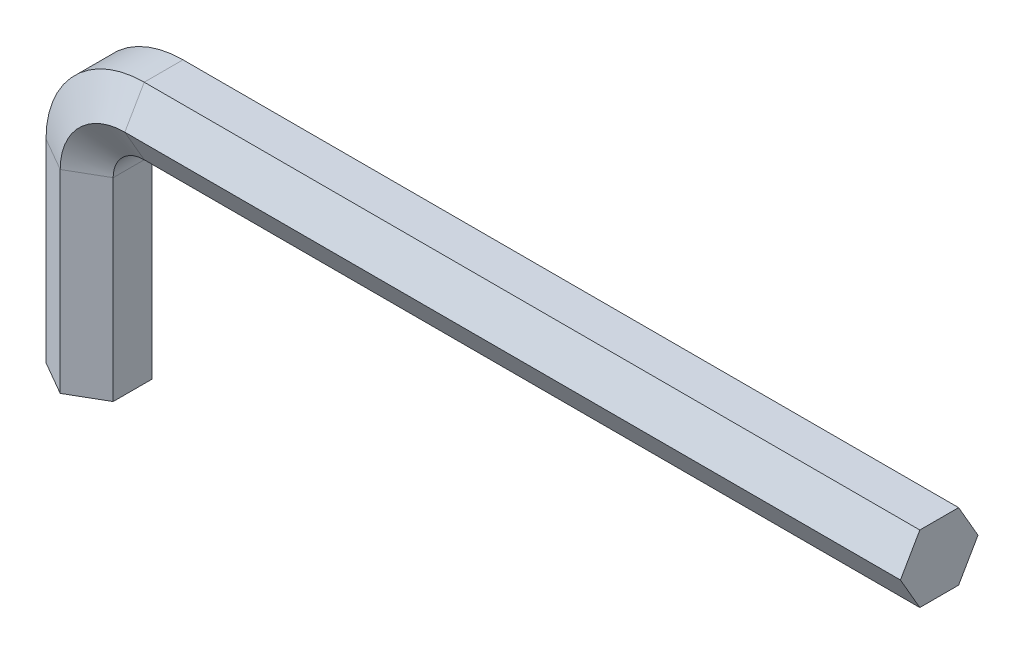
ISO-10303-21;
HEADER;
FILE_DESCRIPTION(('STEP AP214'),'2;1');
FILE_NAME('part.step','',(''),(''),'','','');
FILE_SCHEMA(('AUTOMOTIVE_DESIGN { 1 0 10303 214 1 1 1 1 }'));
ENDSEC;
DATA;
#1=APPLICATION_CONTEXT('core data for automotive mechanical design processes');
#2=APPLICATION_PROTOCOL_DEFINITION('international standard','automotive_design',2000,#1);
#3=PRODUCT_CONTEXT('',#1,'mechanical');
#4=PRODUCT('Part','Part','',(#3));
#5=PRODUCT_RELATED_PRODUCT_CATEGORY('part','',(#4));
#6=PRODUCT_DEFINITION_FORMATION('','',#4);
#7=PRODUCT_DEFINITION_CONTEXT('part definition',#1,'design');
#8=PRODUCT_DEFINITION('design','',#6,#7);
#9=PRODUCT_DEFINITION_SHAPE('','',#8);
#10=(LENGTH_UNIT() NAMED_UNIT(*) SI_UNIT(.MILLI.,.METRE.));
#11=(NAMED_UNIT(*) PLANE_ANGLE_UNIT() SI_UNIT($,.RADIAN.));
#12=(NAMED_UNIT(*) SI_UNIT($,.STERADIAN.) SOLID_ANGLE_UNIT());
#13=UNCERTAINTY_MEASURE_WITH_UNIT(LENGTH_MEASURE(1.E-05),#10,'distance_accuracy_value','');
#14=(GEOMETRIC_REPRESENTATION_CONTEXT(3) GLOBAL_UNCERTAINTY_ASSIGNED_CONTEXT((#13)) GLOBAL_UNIT_ASSIGNED_CONTEXT((#10,
#11,#12)) REPRESENTATION_CONTEXT('',''));
#15=CARTESIAN_POINT('',(0.,0.,0.));
#16=DIRECTION('',(0.,0.,1.));
#17=DIRECTION('',(1.,0.,0.));
#18=AXIS2_PLACEMENT_3D('',#15,#16,#17);
#19=CARTESIAN_POINT('',(20.,0.,0.));
#20=DIRECTION('',(0.,1.,0.));
#21=DIRECTION('',(0.,0.,-1.));
#22=AXIS2_PLACEMENT_3D('',#19,#20,#21);
#23=PLANE('',#22);
#24=DIRECTION('',(-0.866025403784439,0.,-0.5));
#25=VECTOR('',#24,1.);
#26=CARTESIAN_POINT('',(2.59807621135332,0.,-1.5));
#27=LINE('',#26,#25);
#28=CARTESIAN_POINT('',(2.59807621135332,0.,-1.5));
#29=VERTEX_POINT('',#28);
#30=CARTESIAN_POINT('',(0.,0.,-3.));
#31=VERTEX_POINT('',#30);
#32=EDGE_CURVE('E194',#29,#31,#27,.T.);
#33=ORIENTED_EDGE('',*,*,#32,.F.);
#34=DIRECTION('',(0.,0.,-1.));
#35=VECTOR('',#34,1.);
#36=CARTESIAN_POINT('',(2.59807621135332,0.,1.5));
#37=LINE('',#36,#35);
#38=CARTESIAN_POINT('',(2.59807621135332,0.,1.5));
#39=VERTEX_POINT('',#38);
#40=EDGE_CURVE('E256',#39,#29,#37,.T.);
#41=ORIENTED_EDGE('',*,*,#40,.F.);
#42=DIRECTION('',(0.866025403784439,0.,-0.5));
#43=VECTOR('',#42,1.);
#44=CARTESIAN_POINT('',(0.,0.,3.));
#45=LINE('',#44,#43);
#46=CARTESIAN_POINT('',(0.,0.,3.));
#47=VERTEX_POINT('',#46);
#48=EDGE_CURVE('E236',#47,#39,#45,.T.);
#49=ORIENTED_EDGE('',*,*,#48,.F.);
#50=DIRECTION('',(0.866025403784439,0.,0.5));
#51=VECTOR('',#50,1.);
#52=CARTESIAN_POINT('',(-2.59807621135332,0.,1.5));
#53=LINE('',#52,#51);
#54=CARTESIAN_POINT('',(-2.59807621135332,0.,1.5));
#55=VERTEX_POINT('',#54);
#56=EDGE_CURVE('E141',#55,#47,#53,.T.);
#57=ORIENTED_EDGE('',*,*,#56,.F.);
#58=DIRECTION('',(0.,0.,1.));
#59=VECTOR('',#58,1.);
#60=CARTESIAN_POINT('',(-2.59807621135332,0.,-1.5));
#61=LINE('',#60,#59);
#62=CARTESIAN_POINT('',(-2.59807621135332,0.,-1.5));
#63=VERTEX_POINT('',#62);
#64=EDGE_CURVE('E145',#63,#55,#61,.T.);
#65=ORIENTED_EDGE('',*,*,#64,.F.);
#66=DIRECTION('',(-0.866025403784439,0.,0.5));
#67=VECTOR('',#66,1.);
#68=CARTESIAN_POINT('',(0.,0.,-3.));
#69=LINE('',#68,#67);
#70=EDGE_CURVE('E150',#31,#63,#69,.T.);
#71=ORIENTED_EDGE('',*,*,#70,.F.);
#72=EDGE_LOOP('',(#33,#41,#49,#57,#65,#71));
#73=FACE_BOUND('',#72,.T.);
#74=ADVANCED_FACE('F39',(#73),#23,.F.);
#75=CARTESIAN_POINT('',(65.,0.,0.));
#76=DIRECTION('',(1.,0.,0.));
#77=DIRECTION('',(0.,0.,-1.));
#78=AXIS2_PLACEMENT_3D('',#75,#76,#77);
#79=PLANE('',#78);
#80=DIRECTION('',(0.,0.866025403784439,-0.5));
#81=VECTOR('',#80,1.);
#82=CARTESIAN_POINT('',(65.,17.4019237886467,-1.5));
#83=LINE('',#82,#81);
#84=CARTESIAN_POINT('',(65.,17.4019237886467,-1.5));
#85=VERTEX_POINT('',#84);
#86=CARTESIAN_POINT('',(65.,20.,-3.));
#87=VERTEX_POINT('',#86);
#88=EDGE_CURVE('E161',#85,#87,#83,.T.);
#89=ORIENTED_EDGE('',*,*,#88,.T.);
#90=DIRECTION('',(0.,0.866025403784439,0.5));
#91=VECTOR('',#90,1.);
#92=CARTESIAN_POINT('',(65.,20.,-3.));
#93=LINE('',#92,#91);
#94=CARTESIAN_POINT('',(65.,22.5980762113533,-1.5));
#95=VERTEX_POINT('',#94);
#96=EDGE_CURVE('E164',#87,#95,#93,.T.);
#97=ORIENTED_EDGE('',*,*,#96,.T.);
#98=DIRECTION('',(0.,0.,1.));
#99=VECTOR('',#98,1.);
#100=CARTESIAN_POINT('',(65.,22.5980762113533,-1.5));
#101=LINE('',#100,#99);
#102=CARTESIAN_POINT('',(65.,22.5980762113533,1.5));
#103=VERTEX_POINT('',#102);
#104=EDGE_CURVE('E214',#95,#103,#101,.T.);
#105=ORIENTED_EDGE('',*,*,#104,.T.);
#106=DIRECTION('',(0.,-0.866025403784439,0.5));
#107=VECTOR('',#106,1.);
#108=CARTESIAN_POINT('',(65.,22.5980762113533,1.5));
#109=LINE('',#108,#107);
#110=CARTESIAN_POINT('',(65.,20.,3.));
#111=VERTEX_POINT('',#110);
#112=EDGE_CURVE('E59',#103,#111,#109,.T.);
#113=ORIENTED_EDGE('',*,*,#112,.T.);
#114=DIRECTION('',(0.,-0.866025403784439,-0.5));
#115=VECTOR('',#114,1.);
#116=CARTESIAN_POINT('',(65.,20.,3.));
#117=LINE('',#116,#115);
#118=CARTESIAN_POINT('',(65.,17.4019237886467,1.5));
#119=VERTEX_POINT('',#118);
#120=EDGE_CURVE('E53',#111,#119,#117,.T.);
#121=ORIENTED_EDGE('',*,*,#120,.T.);
#122=DIRECTION('',(0.,0.,-1.));
#123=VECTOR('',#122,1.);
#124=CARTESIAN_POINT('',(65.,17.4019237886467,1.5));
#125=LINE('',#124,#123);
#126=EDGE_CURVE('E11',#119,#85,#125,.T.);
#127=ORIENTED_EDGE('',*,*,#126,.T.);
#128=EDGE_LOOP('',(#89,#97,#105,#113,#121,#127));
#129=FACE_BOUND('',#128,.T.);
#130=ADVANCED_FACE('F163',(#129),#79,.T.);
#131=CARTESIAN_POINT('',(2.59807621135332,0.,-1.5));
#132=DIRECTION('',(0.5,0.,-0.866025403784439));
#133=DIRECTION('',(-0.866025403784439,0.,-0.5));
#134=AXIS2_PLACEMENT_3D('',#131,#132,#133);
#135=PLANE('',#134);
#136=DIRECTION('',(0.,1.,0.));
#137=VECTOR('',#136,1.);
#138=CARTESIAN_POINT('',(0.,0.,-3.));
#139=LINE('',#138,#137);
#140=CARTESIAN_POINT('',(0.,15.,-3.));
#141=VERTEX_POINT('',#140);
#142=EDGE_CURVE('E200',#31,#141,#139,.T.);
#143=ORIENTED_EDGE('',*,*,#142,.T.);
#144=DIRECTION('',(-0.866025403784439,0.,-0.5));
#145=VECTOR('',#144,1.);
#146=CARTESIAN_POINT('',(2.59807621135332,15.,-1.5));
#147=LINE('',#146,#145);
#148=CARTESIAN_POINT('',(2.59807621135332,15.,-1.5));
#149=VERTEX_POINT('',#148);
#150=EDGE_CURVE('E301',#149,#141,#147,.T.);
#151=ORIENTED_EDGE('',*,*,#150,.F.);
#152=DIRECTION('',(0.,1.,0.));
#153=VECTOR('',#152,1.);
#154=CARTESIAN_POINT('',(2.59807621135332,0.,-1.5));
#155=LINE('',#154,#153);
#156=EDGE_CURVE('E277',#29,#149,#155,.T.);
#157=ORIENTED_EDGE('',*,*,#156,.F.);
#158=ORIENTED_EDGE('',*,*,#32,.T.);
#159=EDGE_LOOP('',(#143,#151,#157,#158));
#160=FACE_BOUND('',#159,.T.);
#161=ADVANCED_FACE('F311',(#160),#135,.T.);
#162=CARTESIAN_POINT('',(0.,0.,-3.));
#163=DIRECTION('',(-0.5,0.,-0.866025403784439));
#164=DIRECTION('',(-0.866025403784439,0.,0.5));
#165=AXIS2_PLACEMENT_3D('',#162,#163,#164);
#166=PLANE('',#165);
#167=DIRECTION('',(0.,1.,0.));
#168=VECTOR('',#167,1.);
#169=CARTESIAN_POINT('',(-2.59807621135332,0.,-1.5));
#170=LINE('',#169,#168);
#171=CARTESIAN_POINT('',(-2.59807621135332,15.,-1.5));
#172=VERTEX_POINT('',#171);
#173=EDGE_CURVE('E199',#63,#172,#170,.T.);
#174=ORIENTED_EDGE('',*,*,#173,.T.);
#175=DIRECTION('',(-0.866025403784439,0.,0.5));
#176=VECTOR('',#175,1.);
#177=CARTESIAN_POINT('',(0.,15.,-3.));
#178=LINE('',#177,#176);
#179=EDGE_CURVE('E195',#141,#172,#178,.T.);
#180=ORIENTED_EDGE('',*,*,#179,.F.);
#181=ORIENTED_EDGE('',*,*,#142,.F.);
#182=ORIENTED_EDGE('',*,*,#70,.T.);
#183=EDGE_LOOP('',(#174,#180,#181,#182));
#184=FACE_BOUND('',#183,.T.);
#185=ADVANCED_FACE('F314',(#184),#166,.T.);
#186=CARTESIAN_POINT('',(-2.59807621135332,0.,-1.5));
#187=DIRECTION('',(-1.,0.,0.));
#188=DIRECTION('',(0.,0.,1.));
#189=AXIS2_PLACEMENT_3D('',#186,#187,#188);
#190=PLANE('',#189);
#191=DIRECTION('',(0.,1.,0.));
#192=VECTOR('',#191,1.);
#193=CARTESIAN_POINT('',(-2.59807621135332,0.,1.5));
#194=LINE('',#193,#192);
#195=CARTESIAN_POINT('',(-2.59807621135332,15.,1.5));
#196=VERTEX_POINT('',#195);
#197=EDGE_CURVE('E219',#55,#196,#194,.T.);
#198=ORIENTED_EDGE('',*,*,#197,.T.);
#199=DIRECTION('',(0.,0.,1.));
#200=VECTOR('',#199,1.);
#201=CARTESIAN_POINT('',(-2.59807621135332,15.,-1.5));
#202=LINE('',#201,#200);
#203=EDGE_CURVE('E204',#172,#196,#202,.T.);
#204=ORIENTED_EDGE('',*,*,#203,.F.);
#205=ORIENTED_EDGE('',*,*,#173,.F.);
#206=ORIENTED_EDGE('',*,*,#64,.T.);
#207=EDGE_LOOP('',(#198,#204,#205,#206));
#208=FACE_BOUND('',#207,.T.);
#209=ADVANCED_FACE('F368',(#208),#190,.T.);
#210=CARTESIAN_POINT('',(-2.59807621135332,0.,1.5));
#211=DIRECTION('',(-0.5,0.,0.866025403784439));
#212=DIRECTION('',(0.866025403784439,0.,0.5));
#213=AXIS2_PLACEMENT_3D('',#210,#211,#212);
#214=PLANE('',#213);
#215=DIRECTION('',(0.,1.,0.));
#216=VECTOR('',#215,1.);
#217=CARTESIAN_POINT('',(0.,0.,3.));
#218=LINE('',#217,#216);
#219=CARTESIAN_POINT('',(0.,15.,3.));
#220=VERTEX_POINT('',#219);
#221=EDGE_CURVE('E239',#47,#220,#218,.T.);
#222=ORIENTED_EDGE('',*,*,#221,.T.);
#223=DIRECTION('',(0.866025403784439,0.,0.5));
#224=VECTOR('',#223,1.);
#225=CARTESIAN_POINT('',(-2.59807621135332,15.,1.5));
#226=LINE('',#225,#224);
#227=EDGE_CURVE('E223',#196,#220,#226,.T.);
#228=ORIENTED_EDGE('',*,*,#227,.F.);
#229=ORIENTED_EDGE('',*,*,#197,.F.);
#230=ORIENTED_EDGE('',*,*,#56,.T.);
#231=EDGE_LOOP('',(#222,#228,#229,#230));
#232=FACE_BOUND('',#231,.T.);
#233=ADVANCED_FACE('F376',(#232),#214,.T.);
#234=CARTESIAN_POINT('',(0.,0.,3.));
#235=DIRECTION('',(0.5,0.,0.866025403784439));
#236=DIRECTION('',(0.866025403784439,0.,-0.5));
#237=AXIS2_PLACEMENT_3D('',#234,#235,#236);
#238=PLANE('',#237);
#239=DIRECTION('',(0.,1.,0.));
#240=VECTOR('',#239,1.);
#241=CARTESIAN_POINT('',(2.59807621135332,0.,1.5));
#242=LINE('',#241,#240);
#243=CARTESIAN_POINT('',(2.59807621135332,15.,1.5));
#244=VERTEX_POINT('',#243);
#245=EDGE_CURVE('E259',#39,#244,#242,.T.);
#246=ORIENTED_EDGE('',*,*,#245,.T.);
#247=DIRECTION('',(0.866025403784439,0.,-0.5));
#248=VECTOR('',#247,1.);
#249=CARTESIAN_POINT('',(0.,15.,3.));
#250=LINE('',#249,#248);
#251=EDGE_CURVE('E243',#220,#244,#250,.T.);
#252=ORIENTED_EDGE('',*,*,#251,.F.);
#253=ORIENTED_EDGE('',*,*,#221,.F.);
#254=ORIENTED_EDGE('',*,*,#48,.T.);
#255=EDGE_LOOP('',(#246,#252,#253,#254));
#256=FACE_BOUND('',#255,.T.);
#257=ADVANCED_FACE('F386',(#256),#238,.T.);
#258=CARTESIAN_POINT('',(2.59807621135332,0.,1.5));
#259=DIRECTION('',(1.,0.,0.));
#260=DIRECTION('',(0.,0.,-1.));
#261=AXIS2_PLACEMENT_3D('',#258,#259,#260);
#262=PLANE('',#261);
#263=DIRECTION('',(0.,0.,-1.));
#264=VECTOR('',#263,1.);
#265=CARTESIAN_POINT('',(2.59807621135332,15.,1.5));
#266=LINE('',#265,#264);
#267=EDGE_CURVE('E263',#244,#149,#266,.T.);
#268=ORIENTED_EDGE('',*,*,#267,.F.);
#269=ORIENTED_EDGE('',*,*,#245,.F.);
#270=ORIENTED_EDGE('',*,*,#40,.T.);
#271=ORIENTED_EDGE('',*,*,#156,.T.);
#272=EDGE_LOOP('',(#268,#269,#270,#271));
#273=FACE_BOUND('',#272,.T.);
#274=ADVANCED_FACE('F327',(#273),#262,.T.);
#275=CARTESIAN_POINT('',(5.,15.,-1.5));
#276=DIRECTION('',(0.,0.,-1.));
#277=DIRECTION('',(-1.,0.,0.));
#278=AXIS2_PLACEMENT_3D('',#275,#276,#277);
#279=CONICAL_SURFACE('',#278,2.40192378864668,1.0471975511966);
#280=CARTESIAN_POINT('',(5.,15.,-3.));
#281=DIRECTION('',(0.,0.,-1.));
#282=DIRECTION('',(-1.,0.,0.));
#283=AXIS2_PLACEMENT_3D('',#280,#281,#282);
#284=CIRCLE('',#283,5.);
#285=CARTESIAN_POINT('',(5.00000000000001,20.,-3.));
#286=VERTEX_POINT('',#285);
#287=EDGE_CURVE('E208',#141,#286,#284,.T.);
#288=ORIENTED_EDGE('',*,*,#287,.T.);
#289=DIRECTION('',(0.,0.866025403784439,-0.5));
#290=VECTOR('',#289,1.);
#291=CARTESIAN_POINT('',(5.00000000000001,17.4019237886467,-1.5));
#292=LINE('',#291,#290);
#293=CARTESIAN_POINT('',(5.00000000000001,17.4019237886467,-1.5));
#294=VERTEX_POINT('',#293);
#295=EDGE_CURVE('E184',#294,#286,#292,.T.);
#296=ORIENTED_EDGE('',*,*,#295,.F.);
#297=CARTESIAN_POINT('',(5.,15.,-1.5));
#298=DIRECTION('',(0.,0.,-1.));
#299=DIRECTION('',(-1.,0.,0.));
#300=AXIS2_PLACEMENT_3D('',#297,#298,#299);
#301=CIRCLE('',#300,2.40192378864668);
#302=EDGE_CURVE('E280',#149,#294,#301,.T.);
#303=ORIENTED_EDGE('',*,*,#302,.F.);
#304=ORIENTED_EDGE('',*,*,#150,.T.);
#305=EDGE_LOOP('',(#288,#296,#303,#304));
#306=FACE_BOUND('',#305,.T.);
#307=ADVANCED_FACE('F287',(#306),#279,.F.);
#308=CARTESIAN_POINT('',(5.,15.,-3.));
#309=DIRECTION('',(0.,0.,1.));
#310=DIRECTION('',(1.,0.,0.));
#311=AXIS2_PLACEMENT_3D('',#308,#309,#310);
#312=CONICAL_SURFACE('',#311,5.,1.0471975511966);
#313=CARTESIAN_POINT('',(5.,15.,-1.5));
#314=DIRECTION('',(0.,0.,-1.));
#315=DIRECTION('',(-1.,0.,0.));
#316=AXIS2_PLACEMENT_3D('',#313,#314,#315);
#317=CIRCLE('',#316,7.59807621135332);
#318=CARTESIAN_POINT('',(5.00000000000001,22.5980762113533,-1.5));
#319=VERTEX_POINT('',#318);
#320=EDGE_CURVE('E128',#172,#319,#317,.T.);
#321=ORIENTED_EDGE('',*,*,#320,.T.);
#322=DIRECTION('',(0.,0.866025403784439,0.5));
#323=VECTOR('',#322,1.);
#324=CARTESIAN_POINT('',(5.00000000000001,20.,-3.));
#325=LINE('',#324,#323);
#326=EDGE_CURVE('E205',#286,#319,#325,.T.);
#327=ORIENTED_EDGE('',*,*,#326,.F.);
#328=ORIENTED_EDGE('',*,*,#287,.F.);
#329=ORIENTED_EDGE('',*,*,#179,.T.);
#330=EDGE_LOOP('',(#321,#327,#328,#329));
#331=FACE_BOUND('',#330,.T.);
#332=ADVANCED_FACE('F317',(#331),#312,.T.);
#333=CARTESIAN_POINT('',(5.,15.,0.));
#334=DIRECTION('',(0.,0.,-1.));
#335=DIRECTION('',(-1.,0.,0.));
#336=AXIS2_PLACEMENT_3D('',#333,#334,#335);
#337=CYLINDRICAL_SURFACE('',#336,7.59807621135332);
#338=CARTESIAN_POINT('',(5.,15.,1.5));
#339=DIRECTION('',(0.,0.,-1.));
#340=DIRECTION('',(-1.,0.,0.));
#341=AXIS2_PLACEMENT_3D('',#338,#339,#340);
#342=CIRCLE('',#341,7.59807621135332);
#343=CARTESIAN_POINT('',(5.00000000000001,22.5980762113533,1.5));
#344=VERTEX_POINT('',#343);
#345=EDGE_CURVE('E119',#196,#344,#342,.T.);
#346=ORIENTED_EDGE('',*,*,#345,.T.);
#347=DIRECTION('',(0.,0.,1.));
#348=VECTOR('',#347,1.);
#349=CARTESIAN_POINT('',(5.00000000000001,22.5980762113533,-1.5));
#350=LINE('',#349,#348);
#351=EDGE_CURVE('E210',#319,#344,#350,.T.);
#352=ORIENTED_EDGE('',*,*,#351,.F.);
#353=ORIENTED_EDGE('',*,*,#320,.F.);
#354=ORIENTED_EDGE('',*,*,#203,.T.);
#355=EDGE_LOOP('',(#346,#352,#353,#354));
#356=FACE_BOUND('',#355,.T.);
#357=ADVANCED_FACE('F319',(#356),#337,.T.);
#358=CARTESIAN_POINT('',(5.,15.,1.5));
#359=DIRECTION('',(0.,0.,-1.));
#360=DIRECTION('',(-1.,0.,0.));
#361=AXIS2_PLACEMENT_3D('',#358,#359,#360);
#362=CONICAL_SURFACE('',#361,7.59807621135332,1.0471975511966);
#363=CARTESIAN_POINT('',(5.,15.,3.));
#364=DIRECTION('',(0.,0.,-1.));
#365=DIRECTION('',(-1.,0.,0.));
#366=AXIS2_PLACEMENT_3D('',#363,#364,#365);
#367=CIRCLE('',#366,5.);
#368=CARTESIAN_POINT('',(5.00000000000001,20.,3.));
#369=VERTEX_POINT('',#368);
#370=EDGE_CURVE('E112',#220,#369,#367,.T.);
#371=ORIENTED_EDGE('',*,*,#370,.T.);
#372=DIRECTION('',(0.,-0.866025403784439,0.5));
#373=VECTOR('',#372,1.);
#374=CARTESIAN_POINT('',(5.00000000000001,22.5980762113533,1.5));
#375=LINE('',#374,#373);
#376=EDGE_CURVE('E229',#344,#369,#375,.T.);
#377=ORIENTED_EDGE('',*,*,#376,.F.);
#378=ORIENTED_EDGE('',*,*,#345,.F.);
#379=ORIENTED_EDGE('',*,*,#227,.T.);
#380=EDGE_LOOP('',(#371,#377,#378,#379));
#381=FACE_BOUND('',#380,.T.);
#382=ADVANCED_FACE('F325',(#381),#362,.T.);
#383=CARTESIAN_POINT('',(5.,15.,3.));
#384=DIRECTION('',(0.,0.,1.));
#385=DIRECTION('',(1.,0.,0.));
#386=AXIS2_PLACEMENT_3D('',#383,#384,#385);
#387=CONICAL_SURFACE('',#386,5.,1.0471975511966);
#388=CARTESIAN_POINT('',(5.,15.,1.5));
#389=DIRECTION('',(0.,0.,-1.));
#390=DIRECTION('',(-1.,0.,0.));
#391=AXIS2_PLACEMENT_3D('',#388,#389,#390);
#392=CIRCLE('',#391,2.40192378864668);
#393=CARTESIAN_POINT('',(5.00000000000001,17.4019237886467,1.5));
#394=VERTEX_POINT('',#393);
#395=EDGE_CURVE('E266',#244,#394,#392,.T.);
#396=ORIENTED_EDGE('',*,*,#395,.T.);
#397=DIRECTION('',(0.,-0.866025403784439,-0.5));
#398=VECTOR('',#397,1.);
#399=CARTESIAN_POINT('',(5.00000000000001,20.,3.));
#400=LINE('',#399,#398);
#401=EDGE_CURVE('E248',#369,#394,#400,.T.);
#402=ORIENTED_EDGE('',*,*,#401,.F.);
#403=ORIENTED_EDGE('',*,*,#370,.F.);
#404=ORIENTED_EDGE('',*,*,#251,.T.);
#405=EDGE_LOOP('',(#396,#402,#403,#404));
#406=FACE_BOUND('',#405,.T.);
#407=ADVANCED_FACE('F429',(#406),#387,.F.);
#408=CARTESIAN_POINT('',(5.,15.,0.));
#409=DIRECTION('',(0.,0.,-1.));
#410=DIRECTION('',(-1.,0.,0.));
#411=AXIS2_PLACEMENT_3D('',#408,#409,#410);
#412=CYLINDRICAL_SURFACE('',#411,2.40192378864668);
#413=DIRECTION('',(0.,0.,-1.));
#414=VECTOR('',#413,1.);
#415=CARTESIAN_POINT('',(5.00000000000001,17.4019237886467,1.5));
#416=LINE('',#415,#414);
#417=EDGE_CURVE('E191',#394,#294,#416,.T.);
#418=ORIENTED_EDGE('',*,*,#417,.F.);
#419=ORIENTED_EDGE('',*,*,#395,.F.);
#420=ORIENTED_EDGE('',*,*,#267,.T.);
#421=ORIENTED_EDGE('',*,*,#302,.T.);
#422=EDGE_LOOP('',(#418,#419,#420,#421));
#423=FACE_BOUND('',#422,.T.);
#424=ADVANCED_FACE('F291',(#423),#412,.F.);
#425=CARTESIAN_POINT('',(5.00000000000001,17.4019237886467,-1.5));
#426=DIRECTION('',(0.,-0.5,-0.866025403784439));
#427=DIRECTION('',(0.,0.866025403784439,-0.5));
#428=AXIS2_PLACEMENT_3D('',#425,#426,#427);
#429=PLANE('',#428);
#430=DIRECTION('',(1.,0.,0.));
#431=VECTOR('',#430,1.);
#432=CARTESIAN_POINT('',(5.00000000000001,20.,-3.));
#433=LINE('',#432,#431);
#434=EDGE_CURVE('E170',#286,#87,#433,.T.);
#435=ORIENTED_EDGE('',*,*,#434,.T.);
#436=ORIENTED_EDGE('',*,*,#88,.F.);
#437=DIRECTION('',(1.,0.,0.));
#438=VECTOR('',#437,1.);
#439=CARTESIAN_POINT('',(5.00000000000001,17.4019237886467,-1.5));
#440=LINE('',#439,#438);
#441=EDGE_CURVE('E171',#294,#85,#440,.T.);
#442=ORIENTED_EDGE('',*,*,#441,.F.);
#443=ORIENTED_EDGE('',*,*,#295,.T.);
#444=EDGE_LOOP('',(#435,#436,#442,#443));
#445=FACE_BOUND('',#444,.T.);
#446=ADVANCED_FACE('F182',(#445),#429,.T.);
#447=CARTESIAN_POINT('',(5.00000000000001,20.,-3.));
#448=DIRECTION('',(0.,0.5,-0.866025403784439));
#449=DIRECTION('',(0.,0.866025403784439,0.5));
#450=AXIS2_PLACEMENT_3D('',#447,#448,#449);
#451=PLANE('',#450);
#452=DIRECTION('',(1.,0.,0.));
#453=VECTOR('',#452,1.);
#454=CARTESIAN_POINT('',(5.00000000000001,22.5980762113533,-1.5));
#455=LINE('',#454,#453);
#456=EDGE_CURVE('E178',#319,#95,#455,.T.);
#457=ORIENTED_EDGE('',*,*,#456,.T.);
#458=ORIENTED_EDGE('',*,*,#96,.F.);
#459=ORIENTED_EDGE('',*,*,#434,.F.);
#460=ORIENTED_EDGE('',*,*,#326,.T.);
#461=EDGE_LOOP('',(#457,#458,#459,#460));
#462=FACE_BOUND('',#461,.T.);
#463=ADVANCED_FACE('F175',(#462),#451,.T.);
#464=CARTESIAN_POINT('',(5.00000000000001,22.5980762113533,-1.5));
#465=DIRECTION('',(0.,1.,0.));
#466=DIRECTION('',(0.,0.,1.));
#467=AXIS2_PLACEMENT_3D('',#464,#465,#466);
#468=PLANE('',#467);
#469=DIRECTION('',(1.,0.,0.));
#470=VECTOR('',#469,1.);
#471=CARTESIAN_POINT('',(5.00000000000001,22.5980762113533,1.5));
#472=LINE('',#471,#470);
#473=EDGE_CURVE('E97',#344,#103,#472,.T.);
#474=ORIENTED_EDGE('',*,*,#473,.T.);
#475=ORIENTED_EDGE('',*,*,#104,.F.);
#476=ORIENTED_EDGE('',*,*,#456,.F.);
#477=ORIENTED_EDGE('',*,*,#351,.T.);
#478=EDGE_LOOP('',(#474,#475,#476,#477));
#479=FACE_BOUND('',#478,.T.);
#480=ADVANCED_FACE('F461',(#479),#468,.T.);
#481=CARTESIAN_POINT('',(5.00000000000001,22.5980762113533,1.5));
#482=DIRECTION('',(0.,0.5,0.866025403784439));
#483=DIRECTION('',(0.,-0.866025403784439,0.5));
#484=AXIS2_PLACEMENT_3D('',#481,#482,#483);
#485=PLANE('',#484);
#486=DIRECTION('',(1.,0.,0.));
#487=VECTOR('',#486,1.);
#488=CARTESIAN_POINT('',(5.00000000000001,20.,3.));
#489=LINE('',#488,#487);
#490=EDGE_CURVE('E89',#369,#111,#489,.T.);
#491=ORIENTED_EDGE('',*,*,#490,.T.);
#492=ORIENTED_EDGE('',*,*,#112,.F.);
#493=ORIENTED_EDGE('',*,*,#473,.F.);
#494=ORIENTED_EDGE('',*,*,#376,.T.);
#495=EDGE_LOOP('',(#491,#492,#493,#494));
#496=FACE_BOUND('',#495,.T.);
#497=ADVANCED_FACE('F337',(#496),#485,.T.);
#498=CARTESIAN_POINT('',(5.00000000000001,20.,3.));
#499=DIRECTION('',(0.,-0.5,0.866025403784439));
#500=DIRECTION('',(0.,-0.866025403784439,-0.5));
#501=AXIS2_PLACEMENT_3D('',#498,#499,#500);
#502=PLANE('',#501);
#503=DIRECTION('',(1.,0.,0.));
#504=VECTOR('',#503,1.);
#505=CARTESIAN_POINT('',(5.00000000000001,17.4019237886467,1.5));
#506=LINE('',#505,#504);
#507=EDGE_CURVE('E47',#394,#119,#506,.T.);
#508=ORIENTED_EDGE('',*,*,#507,.T.);
#509=ORIENTED_EDGE('',*,*,#120,.F.);
#510=ORIENTED_EDGE('',*,*,#490,.F.);
#511=ORIENTED_EDGE('',*,*,#401,.T.);
#512=EDGE_LOOP('',(#508,#509,#510,#511));
#513=FACE_BOUND('',#512,.T.);
#514=ADVANCED_FACE('F332',(#513),#502,.T.);
#515=CARTESIAN_POINT('',(5.00000000000001,17.4019237886467,1.5));
#516=DIRECTION('',(0.,-1.,0.));
#517=DIRECTION('',(0.,0.,-1.));
#518=AXIS2_PLACEMENT_3D('',#515,#516,#517);
#519=PLANE('',#518);
#520=ORIENTED_EDGE('',*,*,#126,.F.);
#521=ORIENTED_EDGE('',*,*,#507,.F.);
#522=ORIENTED_EDGE('',*,*,#417,.T.);
#523=ORIENTED_EDGE('',*,*,#441,.T.);
#524=EDGE_LOOP('',(#520,#521,#522,#523));
#525=FACE_BOUND('',#524,.T.);
#526=ADVANCED_FACE('F282',(#525),#519,.T.);
#527=CLOSED_SHELL('',(#74,#130,#161,#185,#209,#233,#257,#274,#307,#332,#357,#382,#407,#424,#446,
#463,#480,#497,#514,#526));
#528=MANIFOLD_SOLID_BREP('B2',#527);
#529=ADVANCED_BREP_SHAPE_REPRESENTATION('',(#18,#528),#14);
#530=SHAPE_DEFINITION_REPRESENTATION(#9,#529);
ENDSEC;
END-ISO-10303-21;
